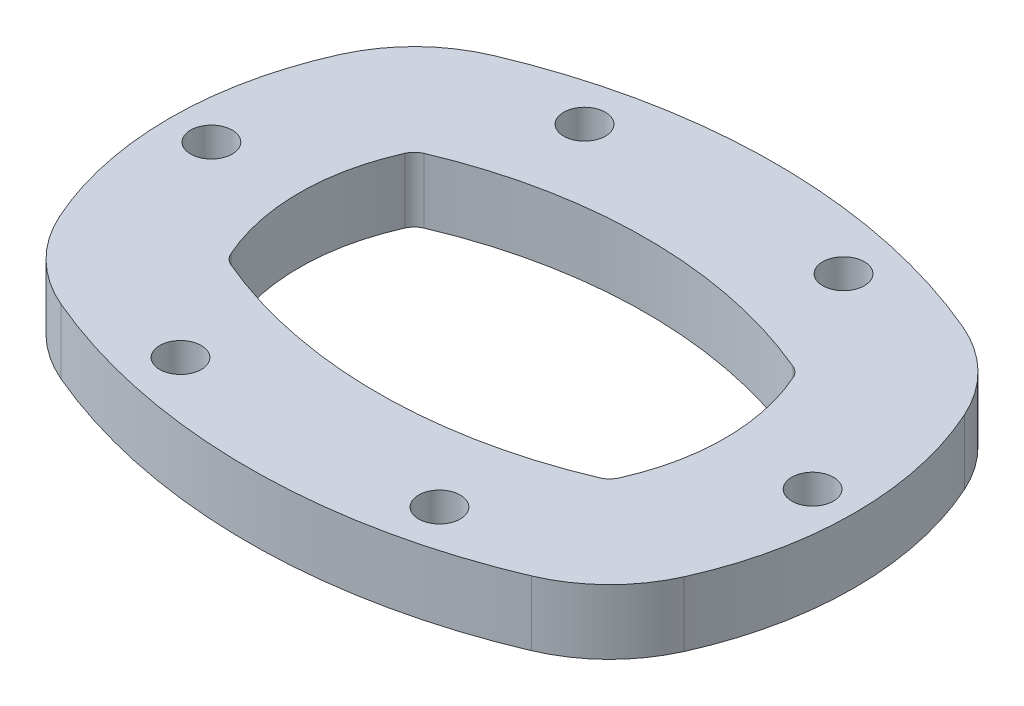
ISO-10303-21;
HEADER;
FILE_DESCRIPTION(('STEP AP214'),'2;1');
FILE_NAME('part.step','',(''),(''),'','','');
FILE_SCHEMA(('AUTOMOTIVE_DESIGN { 1 0 10303 214 1 1 1 1 }'));
ENDSEC;
DATA;
#1=APPLICATION_CONTEXT('core data for automotive mechanical design processes');
#2=APPLICATION_PROTOCOL_DEFINITION('international standard','automotive_design',2000,#1);
#3=PRODUCT_CONTEXT('',#1,'mechanical');
#4=PRODUCT('Part','Part','',(#3));
#5=PRODUCT_RELATED_PRODUCT_CATEGORY('part','',(#4));
#6=PRODUCT_DEFINITION_FORMATION('','',#4);
#7=PRODUCT_DEFINITION_CONTEXT('part definition',#1,'design');
#8=PRODUCT_DEFINITION('design','',#6,#7);
#9=PRODUCT_DEFINITION_SHAPE('','',#8);
#10=(LENGTH_UNIT() NAMED_UNIT(*) SI_UNIT(.MILLI.,.METRE.));
#11=(NAMED_UNIT(*) PLANE_ANGLE_UNIT() SI_UNIT($,.RADIAN.));
#12=(NAMED_UNIT(*) SI_UNIT($,.STERADIAN.) SOLID_ANGLE_UNIT());
#13=UNCERTAINTY_MEASURE_WITH_UNIT(LENGTH_MEASURE(1.E-05),#10,'distance_accuracy_value','');
#14=(GEOMETRIC_REPRESENTATION_CONTEXT(3) GLOBAL_UNCERTAINTY_ASSIGNED_CONTEXT((#13)) GLOBAL_UNIT_ASSIGNED_CONTEXT((#10,
#11,#12)) REPRESENTATION_CONTEXT('',''));
#15=CARTESIAN_POINT('',(0.,0.,0.));
#16=DIRECTION('',(0.,0.,1.));
#17=DIRECTION('',(1.,0.,0.));
#18=AXIS2_PLACEMENT_3D('',#15,#16,#17);
#19=CARTESIAN_POINT('',(30.4142703073689,22.225,44.2923373287671));
#20=DIRECTION('',(0.,1.,0.));
#21=DIRECTION('',(0.,0.,1.));
#22=AXIS2_PLACEMENT_3D('',#19,#20,#21);
#23=PLANE('',#22);
#24=CARTESIAN_POINT('',(-44.45,22.225,69.3540922518483));
#25=DIRECTION('',(0.,1.,0.));
#26=DIRECTION('',(0.,0.,-1.));
#27=AXIS2_PLACEMENT_3D('',#24,#25,#26);
#28=CIRCLE('',#27,7.14374999999997);
#29=CARTESIAN_POINT('',(-44.45,22.225,62.2103422518483));
#30=VERTEX_POINT('',#29);
#31=EDGE_CURVE('E396',#30,#30,#28,.T.);
#32=ORIENTED_EDGE('',*,*,#31,.F.);
#33=EDGE_LOOP('',(#32));
#34=FACE_BOUND('',#33,.T.);
#35=CARTESIAN_POINT('',(44.45,22.225,-69.3540922518483));
#36=DIRECTION('',(0.,1.,0.));
#37=DIRECTION('',(0.,0.,-1.));
#38=AXIS2_PLACEMENT_3D('',#35,#36,#37);
#39=CIRCLE('',#38,7.14374999999997);
#40=CARTESIAN_POINT('',(44.45,22.225,-76.4978422518482));
#41=VERTEX_POINT('',#40);
#42=EDGE_CURVE('E408',#41,#41,#39,.T.);
#43=ORIENTED_EDGE('',*,*,#42,.F.);
#44=EDGE_LOOP('',(#43));
#45=FACE_BOUND('',#44,.T.);
#46=CARTESIAN_POINT('',(-44.45,22.225,-69.3540922518483));
#47=DIRECTION('',(0.,1.,0.));
#48=DIRECTION('',(0.,0.,1.));
#49=AXIS2_PLACEMENT_3D('',#46,#47,#48);
#50=CIRCLE('',#49,7.14374999999997);
#51=CARTESIAN_POINT('',(-44.45,22.225,-62.2103422518483));
#52=VERTEX_POINT('',#51);
#53=EDGE_CURVE('E184',#52,#52,#50,.T.);
#54=ORIENTED_EDGE('',*,*,#53,.F.);
#55=EDGE_LOOP('',(#54));
#56=FACE_BOUND('',#55,.T.);
#57=CARTESIAN_POINT('',(60.8285406147378,22.225,-27.3028253424658));
#58=DIRECTION('',(0.,1.,0.));
#59=DIRECTION('',(0.,0.,1.));
#60=AXIS2_PLACEMENT_3D('',#57,#58,#59);
#61=CIRCLE('',#60,50.8);
#62=CARTESIAN_POINT('',(107.174095368824,22.225,-48.1049779843444));
#63=VERTEX_POINT('',#62);
#64=CARTESIAN_POINT('',(80.6909212236318,22.225,-74.0588499440872));
#65=VERTEX_POINT('',#64);
#66=EDGE_CURVE('E214',#63,#65,#61,.T.);
#67=ORIENTED_EDGE('',*,*,#66,.T.);
#68=CARTESIAN_POINT('',(0.,22.225,115.8875));
#69=DIRECTION('',(0.,1.,0.));
#70=DIRECTION('',(0.,0.,1.));
#71=AXIS2_PLACEMENT_3D('',#68,#69,#70);
#72=CIRCLE('',#71,206.375);
#73=CARTESIAN_POINT('',(-80.6909212236317,22.225,-74.0588499440872));
#74=VERTEX_POINT('',#73);
#75=EDGE_CURVE('E217',#65,#74,#72,.T.);
#76=ORIENTED_EDGE('',*,*,#75,.T.);
#77=CARTESIAN_POINT('',(-60.8285406147378,22.225,-27.3028253424658));
#78=DIRECTION('',(0.,1.,0.));
#79=DIRECTION('',(0.,0.,-1.));
#80=AXIS2_PLACEMENT_3D('',#77,#78,#79);
#81=CIRCLE('',#80,50.8);
#82=CARTESIAN_POINT('',(-107.174095368824,22.225,-48.1049779843444));
#83=VERTEX_POINT('',#82);
#84=EDGE_CURVE('E220',#74,#83,#81,.T.);
#85=ORIENTED_EDGE('',*,*,#84,.T.);
#86=CARTESIAN_POINT('',(0.,22.225,0.));
#87=DIRECTION('',(0.,1.,0.));
#88=DIRECTION('',(0.,0.,-1.));
#89=AXIS2_PLACEMENT_3D('',#86,#87,#88);
#90=CIRCLE('',#89,117.475);
#91=CARTESIAN_POINT('',(-107.174095368824,22.225,48.1049779843444));
#92=VERTEX_POINT('',#91);
#93=EDGE_CURVE('E222',#83,#92,#90,.T.);
#94=ORIENTED_EDGE('',*,*,#93,.T.);
#95=CARTESIAN_POINT('',(-60.8285406147378,22.225,27.3028253424658));
#96=DIRECTION('',(0.,1.,0.));
#97=DIRECTION('',(0.,0.,1.));
#98=AXIS2_PLACEMENT_3D('',#95,#96,#97);
#99=CIRCLE('',#98,50.8);
#100=CARTESIAN_POINT('',(-80.6909212236318,22.225,74.0588499440872));
#101=VERTEX_POINT('',#100);
#102=EDGE_CURVE('E224',#92,#101,#99,.T.);
#103=ORIENTED_EDGE('',*,*,#102,.T.);
#104=CARTESIAN_POINT('',(0.,22.225,-115.8875));
#105=DIRECTION('',(0.,1.,0.));
#106=DIRECTION('',(0.,0.,-1.));
#107=AXIS2_PLACEMENT_3D('',#104,#105,#106);
#108=CIRCLE('',#107,206.375);
#109=CARTESIAN_POINT('',(80.6909212236318,22.225,74.0588499440872));
#110=VERTEX_POINT('',#109);
#111=EDGE_CURVE('E226',#101,#110,#108,.T.);
#112=ORIENTED_EDGE('',*,*,#111,.T.);
#113=CARTESIAN_POINT('',(60.8285406147378,22.225,27.3028253424658));
#114=DIRECTION('',(0.,1.,0.));
#115=DIRECTION('',(0.,0.,-1.));
#116=AXIS2_PLACEMENT_3D('',#113,#114,#115);
#117=CIRCLE('',#116,50.8);
#118=CARTESIAN_POINT('',(107.174095368824,22.225,48.1049779843444));
#119=VERTEX_POINT('',#118);
#120=EDGE_CURVE('E228',#110,#119,#117,.T.);
#121=ORIENTED_EDGE('',*,*,#120,.T.);
#122=CARTESIAN_POINT('',(0.,22.225,0.));
#123=DIRECTION('',(0.,1.,0.));
#124=DIRECTION('',(0.,0.,1.));
#125=AXIS2_PLACEMENT_3D('',#122,#123,#124);
#126=CIRCLE('',#125,117.475);
#127=EDGE_CURVE('E230',#119,#63,#126,.T.);
#128=ORIENTED_EDGE('',*,*,#127,.T.);
#129=EDGE_LOOP('',(#67,#76,#85,#94,#103,#112,#121,#128));
#130=FACE_BOUND('',#129,.T.);
#131=CARTESIAN_POINT('',(0.,22.225,-115.8875));
#132=DIRECTION('',(0.,1.,0.));
#133=DIRECTION('',(0.,0.,-1.));
#134=AXIS2_PLACEMENT_3D('',#131,#132,#133);
#135=CIRCLE('',#134,161.925);
#136=CARTESIAN_POINT('',(-63.3113381908496,22.225,33.1473284176684));
#137=VERTEX_POINT('',#136);
#138=CARTESIAN_POINT('',(63.3113381908496,22.225,33.1473284176684));
#139=VERTEX_POINT('',#138);
#140=EDGE_CURVE('E154',#137,#139,#135,.T.);
#141=ORIENTED_EDGE('',*,*,#140,.F.);
#142=CARTESIAN_POINT('',(-60.8285406147378,22.225,27.3028253424658));
#143=DIRECTION('',(0.,1.,0.));
#144=DIRECTION('',(0.,0.,1.));
#145=AXIS2_PLACEMENT_3D('',#142,#143,#144);
#146=CIRCLE('',#145,6.35);
#147=CARTESIAN_POINT('',(-66.6217349589986,22.225,29.9030944227006));
#148=VERTEX_POINT('',#147);
#149=EDGE_CURVE('E146',#148,#137,#146,.T.);
#150=ORIENTED_EDGE('',*,*,#149,.F.);
#151=CARTESIAN_POINT('',(0.,22.225,0.));
#152=DIRECTION('',(0.,1.,0.));
#153=DIRECTION('',(0.,0.,-1.));
#154=AXIS2_PLACEMENT_3D('',#151,#152,#153);
#155=CIRCLE('',#154,73.025);
#156=CARTESIAN_POINT('',(-66.6217349589986,22.225,-29.9030944227006));
#157=VERTEX_POINT('',#156);
#158=EDGE_CURVE('E181',#157,#148,#155,.T.);
#159=ORIENTED_EDGE('',*,*,#158,.F.);
#160=CARTESIAN_POINT('',(-60.8285406147378,22.225,-27.3028253424658));
#161=DIRECTION('',(0.,1.,0.));
#162=DIRECTION('',(0.,0.,-1.));
#163=AXIS2_PLACEMENT_3D('',#160,#161,#162);
#164=CIRCLE('',#163,6.35);
#165=CARTESIAN_POINT('',(-63.3113381908496,22.225,-33.1473284176684));
#166=VERTEX_POINT('',#165);
#167=EDGE_CURVE('E179',#166,#157,#164,.T.);
#168=ORIENTED_EDGE('',*,*,#167,.F.);
#169=CARTESIAN_POINT('',(0.,22.225,115.8875));
#170=DIRECTION('',(0.,1.,0.));
#171=DIRECTION('',(0.,0.,1.));
#172=AXIS2_PLACEMENT_3D('',#169,#170,#171);
#173=CIRCLE('',#172,161.925);
#174=CARTESIAN_POINT('',(63.3113381908496,22.225,-33.1473284176684));
#175=VERTEX_POINT('',#174);
#176=EDGE_CURVE('E177',#175,#166,#173,.T.);
#177=ORIENTED_EDGE('',*,*,#176,.F.);
#178=CARTESIAN_POINT('',(60.8285406147378,22.225,-27.3028253424658));
#179=DIRECTION('',(0.,1.,0.));
#180=DIRECTION('',(0.,0.,1.));
#181=AXIS2_PLACEMENT_3D('',#178,#179,#180);
#182=CIRCLE('',#181,6.35);
#183=CARTESIAN_POINT('',(66.6217349589986,22.225,-29.9030944227006));
#184=VERTEX_POINT('',#183);
#185=EDGE_CURVE('E175',#184,#175,#182,.T.);
#186=ORIENTED_EDGE('',*,*,#185,.F.);
#187=CARTESIAN_POINT('',(0.,22.225,0.));
#188=DIRECTION('',(0.,1.,0.));
#189=DIRECTION('',(0.,0.,1.));
#190=AXIS2_PLACEMENT_3D('',#187,#188,#189);
#191=CIRCLE('',#190,73.025);
#192=CARTESIAN_POINT('',(66.6217349589986,22.225,29.9030944227006));
#193=VERTEX_POINT('',#192);
#194=EDGE_CURVE('E170',#193,#184,#191,.T.);
#195=ORIENTED_EDGE('',*,*,#194,.F.);
#196=CARTESIAN_POINT('',(60.8285406147378,22.225,27.3028253424658));
#197=DIRECTION('',(0.,1.,0.));
#198=DIRECTION('',(0.,0.,-1.));
#199=AXIS2_PLACEMENT_3D('',#196,#197,#198);
#200=CIRCLE('',#199,6.35);
#201=EDGE_CURVE('E168',#139,#193,#200,.T.);
#202=ORIENTED_EDGE('',*,*,#201,.F.);
#203=EDGE_LOOP('',(#141,#150,#159,#168,#177,#186,#195,#202));
#204=FACE_BOUND('',#203,.T.);
#205=CARTESIAN_POINT('',(-103.1875,22.225,0.));
#206=DIRECTION('',(0.,1.,0.));
#207=DIRECTION('',(0.,0.,1.));
#208=AXIS2_PLACEMENT_3D('',#205,#206,#207);
#209=CIRCLE('',#208,7.14375);
#210=CARTESIAN_POINT('',(-103.1875,22.225,7.14375));
#211=VERTEX_POINT('',#210);
#212=EDGE_CURVE('E414',#211,#211,#209,.T.);
#213=ORIENTED_EDGE('',*,*,#212,.F.);
#214=EDGE_LOOP('',(#213));
#215=FACE_BOUND('',#214,.T.);
#216=CARTESIAN_POINT('',(103.1875,22.225,0.));
#217=DIRECTION('',(0.,1.,0.));
#218=DIRECTION('',(0.,0.,-1.));
#219=AXIS2_PLACEMENT_3D('',#216,#217,#218);
#220=CIRCLE('',#219,7.14375);
#221=CARTESIAN_POINT('',(103.1875,22.225,-7.14375));
#222=VERTEX_POINT('',#221);
#223=EDGE_CURVE('E402',#222,#222,#220,.T.);
#224=ORIENTED_EDGE('',*,*,#223,.F.);
#225=EDGE_LOOP('',(#224));
#226=FACE_BOUND('',#225,.T.);
#227=CARTESIAN_POINT('',(44.45,22.225,69.3540922518483));
#228=DIRECTION('',(0.,1.,0.));
#229=DIRECTION('',(0.,0.,1.));
#230=AXIS2_PLACEMENT_3D('',#227,#228,#229);
#231=CIRCLE('',#230,7.14374999999997);
#232=CARTESIAN_POINT('',(44.45,22.225,76.4978422518482));
#233=VERTEX_POINT('',#232);
#234=EDGE_CURVE('E387',#233,#233,#231,.T.);
#235=ORIENTED_EDGE('',*,*,#234,.F.);
#236=EDGE_LOOP('',(#235));
#237=FACE_BOUND('',#236,.T.);
#238=ADVANCED_FACE('F33',(#34,#45,#56,#130,#204,#215,#226,#237),#23,.T.);
#239=CARTESIAN_POINT('',(30.4142703073689,0.,44.2923373287671));
#240=DIRECTION('',(0.,1.,0.));
#241=DIRECTION('',(0.,0.,1.));
#242=AXIS2_PLACEMENT_3D('',#239,#240,#241);
#243=PLANE('',#242);
#244=CARTESIAN_POINT('',(60.8285406147378,0.,-27.3028253424658));
#245=DIRECTION('',(0.,1.,0.));
#246=DIRECTION('',(0.,0.,1.));
#247=AXIS2_PLACEMENT_3D('',#244,#245,#246);
#248=CIRCLE('',#247,50.8);
#249=CARTESIAN_POINT('',(107.174095368824,0.,-48.1049779843444));
#250=VERTEX_POINT('',#249);
#251=CARTESIAN_POINT('',(80.6909212236318,0.,-74.0588499440872));
#252=VERTEX_POINT('',#251);
#253=EDGE_CURVE('E162',#250,#252,#248,.T.);
#254=ORIENTED_EDGE('',*,*,#253,.F.);
#255=CARTESIAN_POINT('',(0.,0.,0.));
#256=DIRECTION('',(0.,1.,0.));
#257=DIRECTION('',(0.,0.,1.));
#258=AXIS2_PLACEMENT_3D('',#255,#256,#257);
#259=CIRCLE('',#258,117.475);
#260=CARTESIAN_POINT('',(107.174095368824,0.,48.1049779843444));
#261=VERTEX_POINT('',#260);
#262=EDGE_CURVE('E218',#261,#250,#259,.T.);
#263=ORIENTED_EDGE('',*,*,#262,.F.);
#264=CARTESIAN_POINT('',(60.8285406147378,0.,27.3028253424658));
#265=DIRECTION('',(0.,1.,0.));
#266=DIRECTION('',(0.,0.,-1.));
#267=AXIS2_PLACEMENT_3D('',#264,#265,#266);
#268=CIRCLE('',#267,50.8);
#269=CARTESIAN_POINT('',(80.6909212236318,0.,74.0588499440872));
#270=VERTEX_POINT('',#269);
#271=EDGE_CURVE('E245',#270,#261,#268,.T.);
#272=ORIENTED_EDGE('',*,*,#271,.F.);
#273=CARTESIAN_POINT('',(0.,0.,-115.8875));
#274=DIRECTION('',(0.,1.,0.));
#275=DIRECTION('',(0.,0.,-1.));
#276=AXIS2_PLACEMENT_3D('',#273,#274,#275);
#277=CIRCLE('',#276,206.375);
#278=CARTESIAN_POINT('',(-80.6909212236318,0.,74.0588499440872));
#279=VERTEX_POINT('',#278);
#280=EDGE_CURVE('E243',#279,#270,#277,.T.);
#281=ORIENTED_EDGE('',*,*,#280,.F.);
#282=CARTESIAN_POINT('',(-60.8285406147378,0.,27.3028253424658));
#283=DIRECTION('',(0.,1.,0.));
#284=DIRECTION('',(0.,0.,1.));
#285=AXIS2_PLACEMENT_3D('',#282,#283,#284);
#286=CIRCLE('',#285,50.8);
#287=CARTESIAN_POINT('',(-107.174095368824,0.,48.1049779843444));
#288=VERTEX_POINT('',#287);
#289=EDGE_CURVE('E241',#288,#279,#286,.T.);
#290=ORIENTED_EDGE('',*,*,#289,.F.);
#291=CARTESIAN_POINT('',(0.,0.,0.));
#292=DIRECTION('',(0.,1.,0.));
#293=DIRECTION('',(0.,0.,-1.));
#294=AXIS2_PLACEMENT_3D('',#291,#292,#293);
#295=CIRCLE('',#294,117.475);
#296=CARTESIAN_POINT('',(-107.174095368824,0.,-48.1049779843444));
#297=VERTEX_POINT('',#296);
#298=EDGE_CURVE('E239',#297,#288,#295,.T.);
#299=ORIENTED_EDGE('',*,*,#298,.F.);
#300=CARTESIAN_POINT('',(-60.8285406147378,0.,-27.3028253424658));
#301=DIRECTION('',(0.,1.,0.));
#302=DIRECTION('',(0.,0.,-1.));
#303=AXIS2_PLACEMENT_3D('',#300,#301,#302);
#304=CIRCLE('',#303,50.8);
#305=CARTESIAN_POINT('',(-80.6909212236317,0.,-74.0588499440872));
#306=VERTEX_POINT('',#305);
#307=EDGE_CURVE('E237',#306,#297,#304,.T.);
#308=ORIENTED_EDGE('',*,*,#307,.F.);
#309=CARTESIAN_POINT('',(0.,0.,115.8875));
#310=DIRECTION('',(0.,1.,0.));
#311=DIRECTION('',(0.,0.,1.));
#312=AXIS2_PLACEMENT_3D('',#309,#310,#311);
#313=CIRCLE('',#312,206.375);
#314=EDGE_CURVE('E235',#252,#306,#313,.T.);
#315=ORIENTED_EDGE('',*,*,#314,.F.);
#316=EDGE_LOOP('',(#254,#263,#272,#281,#290,#299,#308,#315));
#317=FACE_BOUND('',#316,.T.);
#318=CARTESIAN_POINT('',(-60.8285406147378,0.,27.3028253424658));
#319=DIRECTION('',(0.,1.,0.));
#320=DIRECTION('',(0.,0.,1.));
#321=AXIS2_PLACEMENT_3D('',#318,#319,#320);
#322=CIRCLE('',#321,6.35);
#323=CARTESIAN_POINT('',(-66.6217349589986,0.,29.9030944227006));
#324=VERTEX_POINT('',#323);
#325=CARTESIAN_POINT('',(-63.3113381908496,0.,33.1473284176684));
#326=VERTEX_POINT('',#325);
#327=EDGE_CURVE('E56',#324,#326,#322,.T.);
#328=ORIENTED_EDGE('',*,*,#327,.T.);
#329=CARTESIAN_POINT('',(0.,0.,-115.8875));
#330=DIRECTION('',(0.,1.,0.));
#331=DIRECTION('',(0.,0.,-1.));
#332=AXIS2_PLACEMENT_3D('',#329,#330,#331);
#333=CIRCLE('',#332,161.925);
#334=CARTESIAN_POINT('',(63.3113381908496,0.,33.1473284176684));
#335=VERTEX_POINT('',#334);
#336=EDGE_CURVE('E161',#326,#335,#333,.T.);
#337=ORIENTED_EDGE('',*,*,#336,.T.);
#338=CARTESIAN_POINT('',(60.8285406147378,0.,27.3028253424658));
#339=DIRECTION('',(0.,1.,0.));
#340=DIRECTION('',(0.,0.,-1.));
#341=AXIS2_PLACEMENT_3D('',#338,#339,#340);
#342=CIRCLE('',#341,6.35);
#343=CARTESIAN_POINT('',(66.6217349589986,0.,29.9030944227006));
#344=VERTEX_POINT('',#343);
#345=EDGE_CURVE('E186',#335,#344,#342,.T.);
#346=ORIENTED_EDGE('',*,*,#345,.T.);
#347=CARTESIAN_POINT('',(0.,0.,0.));
#348=DIRECTION('',(0.,1.,0.));
#349=DIRECTION('',(0.,0.,1.));
#350=AXIS2_PLACEMENT_3D('',#347,#348,#349);
#351=CIRCLE('',#350,73.025);
#352=CARTESIAN_POINT('',(66.6217349589986,0.,-29.9030944227006));
#353=VERTEX_POINT('',#352);
#354=EDGE_CURVE('E189',#344,#353,#351,.T.);
#355=ORIENTED_EDGE('',*,*,#354,.T.);
#356=CARTESIAN_POINT('',(60.8285406147378,0.,-27.3028253424658));
#357=DIRECTION('',(0.,1.,0.));
#358=DIRECTION('',(0.,0.,1.));
#359=AXIS2_PLACEMENT_3D('',#356,#357,#358);
#360=CIRCLE('',#359,6.35);
#361=CARTESIAN_POINT('',(63.3113381908496,0.,-33.1473284176684));
#362=VERTEX_POINT('',#361);
#363=EDGE_CURVE('E192',#353,#362,#360,.T.);
#364=ORIENTED_EDGE('',*,*,#363,.T.);
#365=CARTESIAN_POINT('',(0.,0.,115.8875));
#366=DIRECTION('',(0.,1.,0.));
#367=DIRECTION('',(0.,0.,1.));
#368=AXIS2_PLACEMENT_3D('',#365,#366,#367);
#369=CIRCLE('',#368,161.925);
#370=CARTESIAN_POINT('',(-63.3113381908496,0.,-33.1473284176684));
#371=VERTEX_POINT('',#370);
#372=EDGE_CURVE('E195',#362,#371,#369,.T.);
#373=ORIENTED_EDGE('',*,*,#372,.T.);
#374=CARTESIAN_POINT('',(-60.8285406147378,0.,-27.3028253424658));
#375=DIRECTION('',(0.,1.,0.));
#376=DIRECTION('',(0.,0.,-1.));
#377=AXIS2_PLACEMENT_3D('',#374,#375,#376);
#378=CIRCLE('',#377,6.35);
#379=CARTESIAN_POINT('',(-66.6217349589986,0.,-29.9030944227006));
#380=VERTEX_POINT('',#379);
#381=EDGE_CURVE('E198',#371,#380,#378,.T.);
#382=ORIENTED_EDGE('',*,*,#381,.T.);
#383=CARTESIAN_POINT('',(0.,0.,0.));
#384=DIRECTION('',(0.,1.,0.));
#385=DIRECTION('',(0.,0.,-1.));
#386=AXIS2_PLACEMENT_3D('',#383,#384,#385);
#387=CIRCLE('',#386,73.025);
#388=EDGE_CURVE('E155',#380,#324,#387,.T.);
#389=ORIENTED_EDGE('',*,*,#388,.T.);
#390=EDGE_LOOP('',(#328,#337,#346,#355,#364,#373,#382,#389));
#391=FACE_BOUND('',#390,.T.);
#392=CARTESIAN_POINT('',(-44.45,0.,-69.3540922518483));
#393=DIRECTION('',(0.,1.,0.));
#394=DIRECTION('',(0.,0.,1.));
#395=AXIS2_PLACEMENT_3D('',#392,#393,#394);
#396=CIRCLE('',#395,7.14374999999997);
#397=CARTESIAN_POINT('',(-44.45,0.,-62.2103422518483));
#398=VERTEX_POINT('',#397);
#399=EDGE_CURVE('E417',#398,#398,#396,.T.);
#400=ORIENTED_EDGE('',*,*,#399,.T.);
#401=EDGE_LOOP('',(#400));
#402=FACE_BOUND('',#401,.T.);
#403=CARTESIAN_POINT('',(-103.1875,0.,0.));
#404=DIRECTION('',(0.,1.,0.));
#405=DIRECTION('',(0.,0.,1.));
#406=AXIS2_PLACEMENT_3D('',#403,#404,#405);
#407=CIRCLE('',#406,7.14375);
#408=CARTESIAN_POINT('',(-103.1875,0.,7.14375));
#409=VERTEX_POINT('',#408);
#410=EDGE_CURVE('E411',#409,#409,#407,.T.);
#411=ORIENTED_EDGE('',*,*,#410,.T.);
#412=EDGE_LOOP('',(#411));
#413=FACE_BOUND('',#412,.T.);
#414=CARTESIAN_POINT('',(44.45,0.,-69.3540922518483));
#415=DIRECTION('',(0.,1.,0.));
#416=DIRECTION('',(0.,0.,-1.));
#417=AXIS2_PLACEMENT_3D('',#414,#415,#416);
#418=CIRCLE('',#417,7.14374999999997);
#419=CARTESIAN_POINT('',(44.45,0.,-76.4978422518482));
#420=VERTEX_POINT('',#419);
#421=EDGE_CURVE('E405',#420,#420,#418,.T.);
#422=ORIENTED_EDGE('',*,*,#421,.T.);
#423=EDGE_LOOP('',(#422));
#424=FACE_BOUND('',#423,.T.);
#425=CARTESIAN_POINT('',(103.1875,0.,0.));
#426=DIRECTION('',(0.,1.,0.));
#427=DIRECTION('',(0.,0.,-1.));
#428=AXIS2_PLACEMENT_3D('',#425,#426,#427);
#429=CIRCLE('',#428,7.14375);
#430=CARTESIAN_POINT('',(103.1875,0.,-7.14375));
#431=VERTEX_POINT('',#430);
#432=EDGE_CURVE('E399',#431,#431,#429,.T.);
#433=ORIENTED_EDGE('',*,*,#432,.T.);
#434=EDGE_LOOP('',(#433));
#435=FACE_BOUND('',#434,.T.);
#436=CARTESIAN_POINT('',(-44.45,0.,69.3540922518483));
#437=DIRECTION('',(0.,1.,0.));
#438=DIRECTION('',(0.,0.,-1.));
#439=AXIS2_PLACEMENT_3D('',#436,#437,#438);
#440=CIRCLE('',#439,7.14374999999997);
#441=CARTESIAN_POINT('',(-44.45,0.,62.2103422518483));
#442=VERTEX_POINT('',#441);
#443=EDGE_CURVE('E393',#442,#442,#440,.T.);
#444=ORIENTED_EDGE('',*,*,#443,.T.);
#445=EDGE_LOOP('',(#444));
#446=FACE_BOUND('',#445,.T.);
#447=CARTESIAN_POINT('',(44.45,0.,69.3540922518483));
#448=DIRECTION('',(0.,1.,0.));
#449=DIRECTION('',(0.,0.,1.));
#450=AXIS2_PLACEMENT_3D('',#447,#448,#449);
#451=CIRCLE('',#450,7.14374999999997);
#452=CARTESIAN_POINT('',(44.45,0.,76.4978422518482));
#453=VERTEX_POINT('',#452);
#454=EDGE_CURVE('E390',#453,#453,#451,.T.);
#455=ORIENTED_EDGE('',*,*,#454,.T.);
#456=EDGE_LOOP('',(#455));
#457=FACE_BOUND('',#456,.T.);
#458=ADVANCED_FACE('F275',(#317,#391,#402,#413,#424,#435,#446,#457),#243,.F.);
#459=CARTESIAN_POINT('',(60.8285406147378,22.225,-27.3028253424658));
#460=DIRECTION('',(0.,-1.,0.));
#461=DIRECTION('',(0.,0.,-1.));
#462=AXIS2_PLACEMENT_3D('',#459,#460,#461);
#463=CYLINDRICAL_SURFACE('',#462,50.8);
#464=ORIENTED_EDGE('',*,*,#253,.T.);
#465=DIRECTION('',(0.,-1.,0.));
#466=VECTOR('',#465,1.);
#467=CARTESIAN_POINT('',(80.6909212236318,22.225,-74.0588499440872));
#468=LINE('',#467,#466);
#469=EDGE_CURVE('E11',#65,#252,#468,.T.);
#470=ORIENTED_EDGE('',*,*,#469,.F.);
#471=ORIENTED_EDGE('',*,*,#66,.F.);
#472=DIRECTION('',(0.,-1.,0.));
#473=VECTOR('',#472,1.);
#474=CARTESIAN_POINT('',(107.174095368824,22.225,-48.1049779843444));
#475=LINE('',#474,#473);
#476=EDGE_CURVE('E232',#63,#250,#475,.T.);
#477=ORIENTED_EDGE('',*,*,#476,.T.);
#478=EDGE_LOOP('',(#464,#470,#471,#477));
#479=FACE_BOUND('',#478,.T.);
#480=ADVANCED_FACE('F35',(#479),#463,.T.);
#481=CARTESIAN_POINT('',(0.,22.225,115.8875));
#482=DIRECTION('',(0.,-1.,0.));
#483=DIRECTION('',(0.,0.,-1.));
#484=AXIS2_PLACEMENT_3D('',#481,#482,#483);
#485=CYLINDRICAL_SURFACE('',#484,206.375);
#486=ORIENTED_EDGE('',*,*,#314,.T.);
#487=DIRECTION('',(0.,-1.,0.));
#488=VECTOR('',#487,1.);
#489=CARTESIAN_POINT('',(-80.6909212236317,22.225,-74.0588499440872));
#490=LINE('',#489,#488);
#491=EDGE_CURVE('E41',#74,#306,#490,.T.);
#492=ORIENTED_EDGE('',*,*,#491,.F.);
#493=ORIENTED_EDGE('',*,*,#75,.F.);
#494=ORIENTED_EDGE('',*,*,#469,.T.);
#495=EDGE_LOOP('',(#486,#492,#493,#494));
#496=FACE_BOUND('',#495,.T.);
#497=ADVANCED_FACE('F292',(#496),#485,.T.);
#498=CARTESIAN_POINT('',(-60.8285406147378,22.225,-27.3028253424658));
#499=DIRECTION('',(0.,-1.,0.));
#500=DIRECTION('',(0.,0.,-1.));
#501=AXIS2_PLACEMENT_3D('',#498,#499,#500);
#502=CYLINDRICAL_SURFACE('',#501,50.8);
#503=ORIENTED_EDGE('',*,*,#307,.T.);
#504=DIRECTION('',(0.,-1.,0.));
#505=VECTOR('',#504,1.);
#506=CARTESIAN_POINT('',(-107.174095368824,22.225,-48.1049779843444));
#507=LINE('',#506,#505);
#508=EDGE_CURVE('E262',#83,#297,#507,.T.);
#509=ORIENTED_EDGE('',*,*,#508,.F.);
#510=ORIENTED_EDGE('',*,*,#84,.F.);
#511=ORIENTED_EDGE('',*,*,#491,.T.);
#512=EDGE_LOOP('',(#503,#509,#510,#511));
#513=FACE_BOUND('',#512,.T.);
#514=ADVANCED_FACE('F269',(#513),#502,.T.);
#515=CARTESIAN_POINT('',(0.,22.225,0.));
#516=DIRECTION('',(0.,-1.,0.));
#517=DIRECTION('',(0.,0.,-1.));
#518=AXIS2_PLACEMENT_3D('',#515,#516,#517);
#519=CYLINDRICAL_SURFACE('',#518,117.475);
#520=ORIENTED_EDGE('',*,*,#298,.T.);
#521=DIRECTION('',(0.,-1.,0.));
#522=VECTOR('',#521,1.);
#523=CARTESIAN_POINT('',(-107.174095368824,22.225,48.1049779843444));
#524=LINE('',#523,#522);
#525=EDGE_CURVE('E259',#92,#288,#524,.T.);
#526=ORIENTED_EDGE('',*,*,#525,.F.);
#527=ORIENTED_EDGE('',*,*,#93,.F.);
#528=ORIENTED_EDGE('',*,*,#508,.T.);
#529=EDGE_LOOP('',(#520,#526,#527,#528));
#530=FACE_BOUND('',#529,.T.);
#531=ADVANCED_FACE('F281',(#530),#519,.T.);
#532=CARTESIAN_POINT('',(-60.8285406147378,22.225,27.3028253424658));
#533=DIRECTION('',(0.,-1.,0.));
#534=DIRECTION('',(0.,0.,-1.));
#535=AXIS2_PLACEMENT_3D('',#532,#533,#534);
#536=CYLINDRICAL_SURFACE('',#535,50.8);
#537=ORIENTED_EDGE('',*,*,#289,.T.);
#538=DIRECTION('',(0.,-1.,0.));
#539=VECTOR('',#538,1.);
#540=CARTESIAN_POINT('',(-80.6909212236318,22.225,74.0588499440872));
#541=LINE('',#540,#539);
#542=EDGE_CURVE('E256',#101,#279,#541,.T.);
#543=ORIENTED_EDGE('',*,*,#542,.F.);
#544=ORIENTED_EDGE('',*,*,#102,.F.);
#545=ORIENTED_EDGE('',*,*,#525,.T.);
#546=EDGE_LOOP('',(#537,#543,#544,#545));
#547=FACE_BOUND('',#546,.T.);
#548=ADVANCED_FACE('F285',(#547),#536,.T.);
#549=CARTESIAN_POINT('',(0.,22.225,-115.8875));
#550=DIRECTION('',(0.,-1.,0.));
#551=DIRECTION('',(0.,0.,-1.));
#552=AXIS2_PLACEMENT_3D('',#549,#550,#551);
#553=CYLINDRICAL_SURFACE('',#552,206.375);
#554=ORIENTED_EDGE('',*,*,#280,.T.);
#555=DIRECTION('',(0.,-1.,0.));
#556=VECTOR('',#555,1.);
#557=CARTESIAN_POINT('',(80.6909212236318,22.225,74.0588499440872));
#558=LINE('',#557,#556);
#559=EDGE_CURVE('E253',#110,#270,#558,.T.);
#560=ORIENTED_EDGE('',*,*,#559,.F.);
#561=ORIENTED_EDGE('',*,*,#111,.F.);
#562=ORIENTED_EDGE('',*,*,#542,.T.);
#563=EDGE_LOOP('',(#554,#560,#561,#562));
#564=FACE_BOUND('',#563,.T.);
#565=ADVANCED_FACE('F305',(#564),#553,.T.);
#566=CARTESIAN_POINT('',(60.8285406147378,22.225,27.3028253424658));
#567=DIRECTION('',(0.,-1.,0.));
#568=DIRECTION('',(0.,0.,-1.));
#569=AXIS2_PLACEMENT_3D('',#566,#567,#568);
#570=CYLINDRICAL_SURFACE('',#569,50.8);
#571=ORIENTED_EDGE('',*,*,#271,.T.);
#572=DIRECTION('',(0.,-1.,0.));
#573=VECTOR('',#572,1.);
#574=CARTESIAN_POINT('',(107.174095368824,22.225,48.1049779843444));
#575=LINE('',#574,#573);
#576=EDGE_CURVE('E250',#119,#261,#575,.T.);
#577=ORIENTED_EDGE('',*,*,#576,.F.);
#578=ORIENTED_EDGE('',*,*,#120,.F.);
#579=ORIENTED_EDGE('',*,*,#559,.T.);
#580=EDGE_LOOP('',(#571,#577,#578,#579));
#581=FACE_BOUND('',#580,.T.);
#582=ADVANCED_FACE('F303',(#581),#570,.T.);
#583=CARTESIAN_POINT('',(0.,22.225,0.));
#584=DIRECTION('',(0.,-1.,0.));
#585=DIRECTION('',(0.,0.,-1.));
#586=AXIS2_PLACEMENT_3D('',#583,#584,#585);
#587=CYLINDRICAL_SURFACE('',#586,117.475);
#588=ORIENTED_EDGE('',*,*,#262,.T.);
#589=ORIENTED_EDGE('',*,*,#476,.F.);
#590=ORIENTED_EDGE('',*,*,#127,.F.);
#591=ORIENTED_EDGE('',*,*,#576,.T.);
#592=EDGE_LOOP('',(#588,#589,#590,#591));
#593=FACE_BOUND('',#592,.T.);
#594=ADVANCED_FACE('F298',(#593),#587,.T.);
#595=CARTESIAN_POINT('',(-60.8285406147378,22.225,27.3028253424658));
#596=DIRECTION('',(0.,-1.,0.));
#597=DIRECTION('',(0.,0.,-1.));
#598=AXIS2_PLACEMENT_3D('',#595,#596,#597);
#599=CYLINDRICAL_SURFACE('',#598,6.35);
#600=ORIENTED_EDGE('',*,*,#327,.F.);
#601=DIRECTION('',(0.,-1.,0.));
#602=VECTOR('',#601,1.);
#603=CARTESIAN_POINT('',(-66.6217349589986,22.225,29.9030944227006));
#604=LINE('',#603,#602);
#605=EDGE_CURVE('E150',#148,#324,#604,.T.);
#606=ORIENTED_EDGE('',*,*,#605,.F.);
#607=ORIENTED_EDGE('',*,*,#149,.T.);
#608=DIRECTION('',(0.,-1.,0.));
#609=VECTOR('',#608,1.);
#610=CARTESIAN_POINT('',(-63.3113381908496,22.225,33.1473284176684));
#611=LINE('',#610,#609);
#612=EDGE_CURVE('E149',#137,#326,#611,.T.);
#613=ORIENTED_EDGE('',*,*,#612,.T.);
#614=EDGE_LOOP('',(#600,#606,#607,#613));
#615=FACE_BOUND('',#614,.T.);
#616=ADVANCED_FACE('F148',(#615),#599,.F.);
#617=CARTESIAN_POINT('',(0.,22.225,-115.8875));
#618=DIRECTION('',(0.,-1.,0.));
#619=DIRECTION('',(0.,0.,-1.));
#620=AXIS2_PLACEMENT_3D('',#617,#618,#619);
#621=CYLINDRICAL_SURFACE('',#620,161.925);
#622=ORIENTED_EDGE('',*,*,#336,.F.);
#623=ORIENTED_EDGE('',*,*,#612,.F.);
#624=ORIENTED_EDGE('',*,*,#140,.T.);
#625=DIRECTION('',(0.,-1.,0.));
#626=VECTOR('',#625,1.);
#627=CARTESIAN_POINT('',(63.3113381908496,22.225,33.1473284176684));
#628=LINE('',#627,#626);
#629=EDGE_CURVE('E163',#139,#335,#628,.T.);
#630=ORIENTED_EDGE('',*,*,#629,.T.);
#631=EDGE_LOOP('',(#622,#623,#624,#630));
#632=FACE_BOUND('',#631,.T.);
#633=ADVANCED_FACE('F158',(#632),#621,.F.);
#634=CARTESIAN_POINT('',(60.8285406147378,22.225,27.3028253424658));
#635=DIRECTION('',(0.,-1.,0.));
#636=DIRECTION('',(0.,0.,-1.));
#637=AXIS2_PLACEMENT_3D('',#634,#635,#636);
#638=CYLINDRICAL_SURFACE('',#637,6.35);
#639=ORIENTED_EDGE('',*,*,#345,.F.);
#640=ORIENTED_EDGE('',*,*,#629,.F.);
#641=ORIENTED_EDGE('',*,*,#201,.T.);
#642=DIRECTION('',(0.,-1.,0.));
#643=VECTOR('',#642,1.);
#644=CARTESIAN_POINT('',(66.6217349589986,22.225,29.9030944227006));
#645=LINE('',#644,#643);
#646=EDGE_CURVE('E211',#193,#344,#645,.T.);
#647=ORIENTED_EDGE('',*,*,#646,.T.);
#648=EDGE_LOOP('',(#639,#640,#641,#647));
#649=FACE_BOUND('',#648,.T.);
#650=ADVANCED_FACE('F333',(#649),#638,.F.);
#651=CARTESIAN_POINT('',(0.,22.225,0.));
#652=DIRECTION('',(0.,-1.,0.));
#653=DIRECTION('',(0.,0.,-1.));
#654=AXIS2_PLACEMENT_3D('',#651,#652,#653);
#655=CYLINDRICAL_SURFACE('',#654,73.025);
#656=ORIENTED_EDGE('',*,*,#354,.F.);
#657=ORIENTED_EDGE('',*,*,#646,.F.);
#658=ORIENTED_EDGE('',*,*,#194,.T.);
#659=DIRECTION('',(0.,-1.,0.));
#660=VECTOR('',#659,1.);
#661=CARTESIAN_POINT('',(66.6217349589986,22.225,-29.9030944227006));
#662=LINE('',#661,#660);
#663=EDGE_CURVE('E209',#184,#353,#662,.T.);
#664=ORIENTED_EDGE('',*,*,#663,.T.);
#665=EDGE_LOOP('',(#656,#657,#658,#664));
#666=FACE_BOUND('',#665,.T.);
#667=ADVANCED_FACE('F337',(#666),#655,.F.);
#668=CARTESIAN_POINT('',(60.8285406147378,22.225,-27.3028253424658));
#669=DIRECTION('',(0.,-1.,0.));
#670=DIRECTION('',(0.,0.,-1.));
#671=AXIS2_PLACEMENT_3D('',#668,#669,#670);
#672=CYLINDRICAL_SURFACE('',#671,6.35);
#673=ORIENTED_EDGE('',*,*,#363,.F.);
#674=ORIENTED_EDGE('',*,*,#663,.F.);
#675=ORIENTED_EDGE('',*,*,#185,.T.);
#676=DIRECTION('',(0.,-1.,0.));
#677=VECTOR('',#676,1.);
#678=CARTESIAN_POINT('',(63.3113381908496,22.225,-33.1473284176684));
#679=LINE('',#678,#677);
#680=EDGE_CURVE('E207',#175,#362,#679,.T.);
#681=ORIENTED_EDGE('',*,*,#680,.T.);
#682=EDGE_LOOP('',(#673,#674,#675,#681));
#683=FACE_BOUND('',#682,.T.);
#684=ADVANCED_FACE('F343',(#683),#672,.F.);
#685=CARTESIAN_POINT('',(0.,22.225,115.8875));
#686=DIRECTION('',(0.,-1.,0.));
#687=DIRECTION('',(0.,0.,-1.));
#688=AXIS2_PLACEMENT_3D('',#685,#686,#687);
#689=CYLINDRICAL_SURFACE('',#688,161.925);
#690=ORIENTED_EDGE('',*,*,#372,.F.);
#691=ORIENTED_EDGE('',*,*,#680,.F.);
#692=ORIENTED_EDGE('',*,*,#176,.T.);
#693=DIRECTION('',(0.,-1.,0.));
#694=VECTOR('',#693,1.);
#695=CARTESIAN_POINT('',(-63.3113381908496,22.225,-33.1473284176684));
#696=LINE('',#695,#694);
#697=EDGE_CURVE('E205',#166,#371,#696,.T.);
#698=ORIENTED_EDGE('',*,*,#697,.T.);
#699=EDGE_LOOP('',(#690,#691,#692,#698));
#700=FACE_BOUND('',#699,.T.);
#701=ADVANCED_FACE('F347',(#700),#689,.F.);
#702=CARTESIAN_POINT('',(-60.8285406147378,22.225,-27.3028253424658));
#703=DIRECTION('',(0.,-1.,0.));
#704=DIRECTION('',(0.,0.,-1.));
#705=AXIS2_PLACEMENT_3D('',#702,#703,#704);
#706=CYLINDRICAL_SURFACE('',#705,6.35);
#707=ORIENTED_EDGE('',*,*,#381,.F.);
#708=ORIENTED_EDGE('',*,*,#697,.F.);
#709=ORIENTED_EDGE('',*,*,#167,.T.);
#710=DIRECTION('',(0.,-1.,0.));
#711=VECTOR('',#710,1.);
#712=CARTESIAN_POINT('',(-66.6217349589986,22.225,-29.9030944227006));
#713=LINE('',#712,#711);
#714=EDGE_CURVE('E48',#157,#380,#713,.T.);
#715=ORIENTED_EDGE('',*,*,#714,.T.);
#716=EDGE_LOOP('',(#707,#708,#709,#715));
#717=FACE_BOUND('',#716,.T.);
#718=ADVANCED_FACE('F351',(#717),#706,.F.);
#719=CARTESIAN_POINT('',(0.,22.225,0.));
#720=DIRECTION('',(0.,-1.,0.));
#721=DIRECTION('',(0.,0.,-1.));
#722=AXIS2_PLACEMENT_3D('',#719,#720,#721);
#723=CYLINDRICAL_SURFACE('',#722,73.025);
#724=ORIENTED_EDGE('',*,*,#388,.F.);
#725=ORIENTED_EDGE('',*,*,#714,.F.);
#726=ORIENTED_EDGE('',*,*,#158,.T.);
#727=ORIENTED_EDGE('',*,*,#605,.T.);
#728=EDGE_LOOP('',(#724,#725,#726,#727));
#729=FACE_BOUND('',#728,.T.);
#730=ADVANCED_FACE('F355',(#729),#723,.F.);
#731=CARTESIAN_POINT('',(-44.45,22.225,-69.3540922518483));
#732=DIRECTION('',(0.,-1.,0.));
#733=DIRECTION('',(0.,0.,-1.));
#734=AXIS2_PLACEMENT_3D('',#731,#732,#733);
#735=CYLINDRICAL_SURFACE('',#734,7.14374999999997);
#736=ORIENTED_EDGE('',*,*,#53,.T.);
#737=EDGE_LOOP('',(#736));
#738=FACE_BOUND('',#737,.T.);
#739=ORIENTED_EDGE('',*,*,#399,.F.);
#740=EDGE_LOOP('',(#739));
#741=FACE_BOUND('',#740,.T.);
#742=ADVANCED_FACE('F359',(#738,#741),#735,.F.);
#743=CARTESIAN_POINT('',(-103.1875,22.225,0.));
#744=DIRECTION('',(0.,-1.,0.));
#745=DIRECTION('',(0.,0.,-1.));
#746=AXIS2_PLACEMENT_3D('',#743,#744,#745);
#747=CYLINDRICAL_SURFACE('',#746,7.14375);
#748=ORIENTED_EDGE('',*,*,#212,.T.);
#749=EDGE_LOOP('',(#748));
#750=FACE_BOUND('',#749,.T.);
#751=ORIENTED_EDGE('',*,*,#410,.F.);
#752=EDGE_LOOP('',(#751));
#753=FACE_BOUND('',#752,.T.);
#754=ADVANCED_FACE('F362',(#750,#753),#747,.F.);
#755=CARTESIAN_POINT('',(44.45,22.225,-69.3540922518483));
#756=DIRECTION('',(0.,-1.,0.));
#757=DIRECTION('',(0.,0.,-1.));
#758=AXIS2_PLACEMENT_3D('',#755,#756,#757);
#759=CYLINDRICAL_SURFACE('',#758,7.14374999999997);
#760=ORIENTED_EDGE('',*,*,#42,.T.);
#761=EDGE_LOOP('',(#760));
#762=FACE_BOUND('',#761,.T.);
#763=ORIENTED_EDGE('',*,*,#421,.F.);
#764=EDGE_LOOP('',(#763));
#765=FACE_BOUND('',#764,.T.);
#766=ADVANCED_FACE('F366',(#762,#765),#759,.F.);
#767=CARTESIAN_POINT('',(103.1875,22.225,0.));
#768=DIRECTION('',(0.,-1.,0.));
#769=DIRECTION('',(0.,0.,-1.));
#770=AXIS2_PLACEMENT_3D('',#767,#768,#769);
#771=CYLINDRICAL_SURFACE('',#770,7.14375);
#772=ORIENTED_EDGE('',*,*,#223,.T.);
#773=EDGE_LOOP('',(#772));
#774=FACE_BOUND('',#773,.T.);
#775=ORIENTED_EDGE('',*,*,#432,.F.);
#776=EDGE_LOOP('',(#775));
#777=FACE_BOUND('',#776,.T.);
#778=ADVANCED_FACE('F370',(#774,#777),#771,.F.);
#779=CARTESIAN_POINT('',(-44.45,22.225,69.3540922518483));
#780=DIRECTION('',(0.,-1.,0.));
#781=DIRECTION('',(0.,0.,-1.));
#782=AXIS2_PLACEMENT_3D('',#779,#780,#781);
#783=CYLINDRICAL_SURFACE('',#782,7.14374999999997);
#784=ORIENTED_EDGE('',*,*,#31,.T.);
#785=EDGE_LOOP('',(#784));
#786=FACE_BOUND('',#785,.T.);
#787=ORIENTED_EDGE('',*,*,#443,.F.);
#788=EDGE_LOOP('',(#787));
#789=FACE_BOUND('',#788,.T.);
#790=ADVANCED_FACE('F374',(#786,#789),#783,.F.);
#791=CARTESIAN_POINT('',(44.45,22.225,69.3540922518483));
#792=DIRECTION('',(0.,-1.,0.));
#793=DIRECTION('',(0.,0.,-1.));
#794=AXIS2_PLACEMENT_3D('',#791,#792,#793);
#795=CYLINDRICAL_SURFACE('',#794,7.14374999999997);
#796=ORIENTED_EDGE('',*,*,#234,.T.);
#797=EDGE_LOOP('',(#796));
#798=FACE_BOUND('',#797,.T.);
#799=ORIENTED_EDGE('',*,*,#454,.F.);
#800=EDGE_LOOP('',(#799));
#801=FACE_BOUND('',#800,.T.);
#802=ADVANCED_FACE('F378',(#798,#801),#795,.F.);
#803=CLOSED_SHELL('',(#238,#458,#480,#497,#514,#531,#548,#565,#582,#594,#616,#633,#650,#667,
#684,#701,#718,#730,#742,#754,#766,#778,#790,#802));
#804=MANIFOLD_SOLID_BREP('B2',#803);
#805=ADVANCED_BREP_SHAPE_REPRESENTATION('',(#18,#804),#14);
#806=SHAPE_DEFINITION_REPRESENTATION(#9,#805);
ENDSEC;
END-ISO-10303-21;
